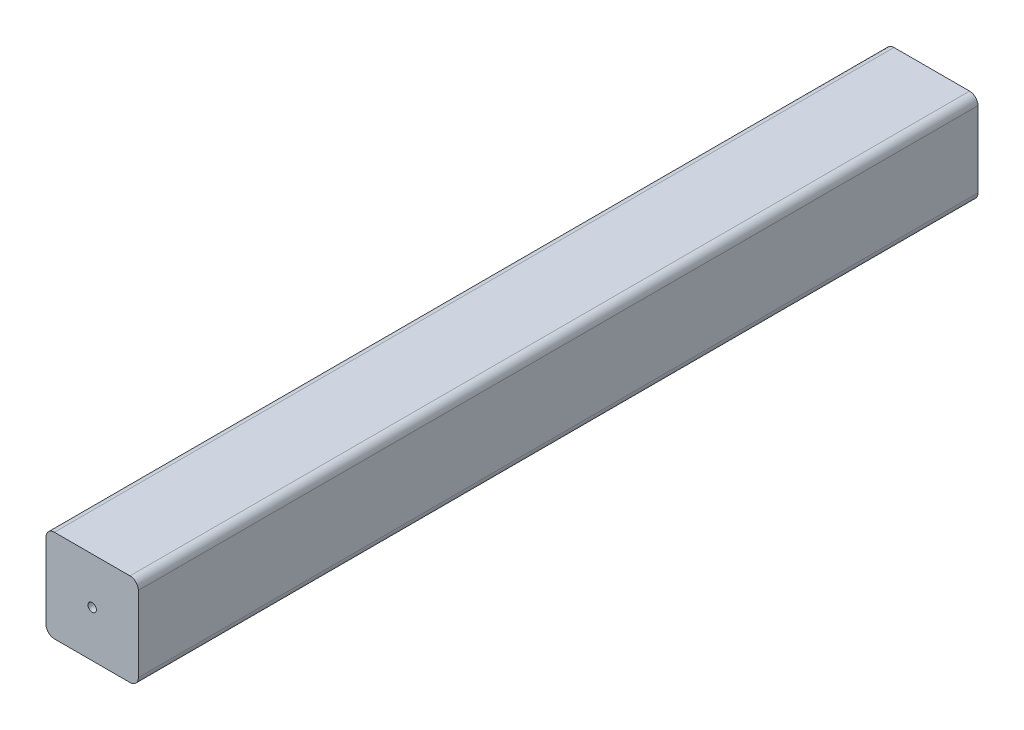
ISO-10303-21;
HEADER;
FILE_DESCRIPTION(('STEP AP214'),'2;1');
FILE_NAME('part.step','',(''),(''),'','','');
FILE_SCHEMA(('AUTOMOTIVE_DESIGN { 1 0 10303 214 1 1 1 1 }'));
ENDSEC;
DATA;
#1=APPLICATION_CONTEXT('core data for automotive mechanical design processes');
#2=APPLICATION_PROTOCOL_DEFINITION('international standard','automotive_design',2000,#1);
#3=PRODUCT_CONTEXT('',#1,'mechanical');
#4=PRODUCT('Part','Part','',(#3));
#5=PRODUCT_RELATED_PRODUCT_CATEGORY('part','',(#4));
#6=PRODUCT_DEFINITION_FORMATION('','',#4);
#7=PRODUCT_DEFINITION_CONTEXT('part definition',#1,'design');
#8=PRODUCT_DEFINITION('design','',#6,#7);
#9=PRODUCT_DEFINITION_SHAPE('','',#8);
#10=(LENGTH_UNIT() NAMED_UNIT(*) SI_UNIT(.MILLI.,.METRE.));
#11=(NAMED_UNIT(*) PLANE_ANGLE_UNIT() SI_UNIT($,.RADIAN.));
#12=(NAMED_UNIT(*) SI_UNIT($,.STERADIAN.) SOLID_ANGLE_UNIT());
#13=UNCERTAINTY_MEASURE_WITH_UNIT(LENGTH_MEASURE(1.E-05),#10,'distance_accuracy_value','');
#14=(GEOMETRIC_REPRESENTATION_CONTEXT(3) GLOBAL_UNCERTAINTY_ASSIGNED_CONTEXT((#13)) GLOBAL_UNIT_ASSIGNED_CONTEXT((#10,
#11,#12)) REPRESENTATION_CONTEXT('',''));
#15=CARTESIAN_POINT('',(0.,0.,0.));
#16=DIRECTION('',(0.,0.,1.));
#17=DIRECTION('',(1.,0.,0.));
#18=AXIS2_PLACEMENT_3D('',#15,#16,#17);
#19=CARTESIAN_POINT('',(-9.,9.,200.));
#20=DIRECTION('',(0.,0.,-1.));
#21=DIRECTION('',(-1.,0.,0.));
#22=AXIS2_PLACEMENT_3D('',#19,#20,#21);
#23=PLANE('',#22);
#24=CARTESIAN_POINT('',(-9.,9.,200.));
#25=DIRECTION('',(0.,0.,1.));
#26=DIRECTION('',(-1.,0.,0.));
#27=AXIS2_PLACEMENT_3D('',#24,#25,#26);
#28=CIRCLE('',#27,2.);
#29=CARTESIAN_POINT('',(-8.99999999999998,11.,200.));
#30=VERTEX_POINT('',#29);
#31=CARTESIAN_POINT('',(-11.,8.99999999999999,200.));
#32=VERTEX_POINT('',#31);
#33=EDGE_CURVE('E143',#30,#32,#28,.T.);
#34=ORIENTED_EDGE('',*,*,#33,.T.);
#35=DIRECTION('',(0.,-1.,0.));
#36=VECTOR('',#35,1.);
#37=CARTESIAN_POINT('',(-11.,-8.99999999999999,200.));
#38=LINE('',#37,#36);
#39=CARTESIAN_POINT('',(-11.,-8.99999999999999,200.));
#40=VERTEX_POINT('',#39);
#41=EDGE_CURVE('E91',#32,#40,#38,.T.);
#42=ORIENTED_EDGE('',*,*,#41,.T.);
#43=CARTESIAN_POINT('',(-9.,-9.,200.));
#44=DIRECTION('',(0.,0.,1.));
#45=DIRECTION('',(-1.,0.,0.));
#46=AXIS2_PLACEMENT_3D('',#43,#44,#45);
#47=CIRCLE('',#46,2.);
#48=CARTESIAN_POINT('',(-8.99999999999998,-11.,200.));
#49=VERTEX_POINT('',#48);
#50=EDGE_CURVE('E158',#40,#49,#47,.T.);
#51=ORIENTED_EDGE('',*,*,#50,.T.);
#52=DIRECTION('',(1.,0.,0.));
#53=VECTOR('',#52,1.);
#54=CARTESIAN_POINT('',(8.99999999999999,-11.,200.));
#55=LINE('',#54,#53);
#56=CARTESIAN_POINT('',(8.99999999999999,-11.,200.));
#57=VERTEX_POINT('',#56);
#58=EDGE_CURVE('E171',#49,#57,#55,.T.);
#59=ORIENTED_EDGE('',*,*,#58,.T.);
#60=CARTESIAN_POINT('',(9.,-9.,200.));
#61=DIRECTION('',(0.,0.,1.));
#62=DIRECTION('',(-1.,0.,0.));
#63=AXIS2_PLACEMENT_3D('',#60,#61,#62);
#64=CIRCLE('',#63,2.);
#65=CARTESIAN_POINT('',(11.,-8.99999999999999,200.));
#66=VERTEX_POINT('',#65);
#67=EDGE_CURVE('E110',#57,#66,#64,.T.);
#68=ORIENTED_EDGE('',*,*,#67,.T.);
#69=DIRECTION('',(0.,1.,0.));
#70=VECTOR('',#69,1.);
#71=CARTESIAN_POINT('',(11.,8.99999999999999,200.));
#72=LINE('',#71,#70);
#73=CARTESIAN_POINT('',(11.,8.99999999999999,200.));
#74=VERTEX_POINT('',#73);
#75=EDGE_CURVE('E104',#66,#74,#72,.T.);
#76=ORIENTED_EDGE('',*,*,#75,.T.);
#77=CARTESIAN_POINT('',(9.,9.,200.));
#78=DIRECTION('',(0.,0.,1.));
#79=DIRECTION('',(-1.,0.,0.));
#80=AXIS2_PLACEMENT_3D('',#77,#78,#79);
#81=CIRCLE('',#80,2.);
#82=CARTESIAN_POINT('',(8.99999999999999,11.,200.));
#83=VERTEX_POINT('',#82);
#84=EDGE_CURVE('E108',#74,#83,#81,.T.);
#85=ORIENTED_EDGE('',*,*,#84,.T.);
#86=DIRECTION('',(-1.,0.,0.));
#87=VECTOR('',#86,1.);
#88=CARTESIAN_POINT('',(-8.99999999999998,11.,200.));
#89=LINE('',#88,#87);
#90=EDGE_CURVE('E48',#83,#30,#89,.T.);
#91=ORIENTED_EDGE('',*,*,#90,.T.);
#92=EDGE_LOOP('',(#34,#42,#51,#59,#68,#76,#85,#91));
#93=FACE_BOUND('',#92,.T.);
#94=CARTESIAN_POINT('',(0.,0.,200.));
#95=DIRECTION('',(0.,0.,1.));
#96=DIRECTION('',(1.,0.,0.));
#97=AXIS2_PLACEMENT_3D('',#94,#95,#96);
#98=CIRCLE('',#97,1.);
#99=CARTESIAN_POINT('',(1.,0.,200.));
#100=VERTEX_POINT('',#99);
#101=EDGE_CURVE('E132',#100,#100,#98,.T.);
#102=ORIENTED_EDGE('',*,*,#101,.F.);
#103=EDGE_LOOP('',(#102));
#104=FACE_BOUND('',#103,.T.);
#105=ADVANCED_FACE('F31',(#93,#104),#23,.F.);
#106=CARTESIAN_POINT('',(-9.,9.,0.));
#107=DIRECTION('',(0.,0.,-1.));
#108=DIRECTION('',(-1.,0.,0.));
#109=AXIS2_PLACEMENT_3D('',#106,#107,#108);
#110=PLANE('',#109);
#111=CARTESIAN_POINT('',(-9.,9.,0.));
#112=DIRECTION('',(0.,0.,1.));
#113=DIRECTION('',(-1.,0.,0.));
#114=AXIS2_PLACEMENT_3D('',#111,#112,#113);
#115=CIRCLE('',#114,2.);
#116=CARTESIAN_POINT('',(-8.99999999999998,11.,0.));
#117=VERTEX_POINT('',#116);
#118=CARTESIAN_POINT('',(-11.,8.99999999999999,0.));
#119=VERTEX_POINT('',#118);
#120=EDGE_CURVE('E128',#117,#119,#115,.T.);
#121=ORIENTED_EDGE('',*,*,#120,.F.);
#122=DIRECTION('',(-1.,0.,0.));
#123=VECTOR('',#122,1.);
#124=CARTESIAN_POINT('',(-8.99999999999998,11.,0.));
#125=LINE('',#124,#123);
#126=CARTESIAN_POINT('',(8.99999999999999,11.,0.));
#127=VERTEX_POINT('',#126);
#128=EDGE_CURVE('E83',#127,#117,#125,.T.);
#129=ORIENTED_EDGE('',*,*,#128,.F.);
#130=CARTESIAN_POINT('',(9.,9.,0.));
#131=DIRECTION('',(0.,0.,1.));
#132=DIRECTION('',(-1.,0.,0.));
#133=AXIS2_PLACEMENT_3D('',#130,#131,#132);
#134=CIRCLE('',#133,2.);
#135=CARTESIAN_POINT('',(11.,8.99999999999999,0.));
#136=VERTEX_POINT('',#135);
#137=EDGE_CURVE('E77',#136,#127,#134,.T.);
#138=ORIENTED_EDGE('',*,*,#137,.F.);
#139=DIRECTION('',(0.,1.,0.));
#140=VECTOR('',#139,1.);
#141=CARTESIAN_POINT('',(11.,8.99999999999999,0.));
#142=LINE('',#141,#140);
#143=CARTESIAN_POINT('',(11.,-8.99999999999999,0.));
#144=VERTEX_POINT('',#143);
#145=EDGE_CURVE('E118',#144,#136,#142,.T.);
#146=ORIENTED_EDGE('',*,*,#145,.F.);
#147=CARTESIAN_POINT('',(9.,-9.,0.));
#148=DIRECTION('',(0.,0.,1.));
#149=DIRECTION('',(-1.,0.,0.));
#150=AXIS2_PLACEMENT_3D('',#147,#148,#149);
#151=CIRCLE('',#150,2.);
#152=CARTESIAN_POINT('',(8.99999999999999,-11.,0.));
#153=VERTEX_POINT('',#152);
#154=EDGE_CURVE('E138',#153,#144,#151,.T.);
#155=ORIENTED_EDGE('',*,*,#154,.F.);
#156=DIRECTION('',(1.,0.,0.));
#157=VECTOR('',#156,1.);
#158=CARTESIAN_POINT('',(8.99999999999999,-11.,0.));
#159=LINE('',#158,#157);
#160=CARTESIAN_POINT('',(-8.99999999999998,-11.,0.));
#161=VERTEX_POINT('',#160);
#162=EDGE_CURVE('E136',#161,#153,#159,.T.);
#163=ORIENTED_EDGE('',*,*,#162,.F.);
#164=CARTESIAN_POINT('',(-9.,-9.,0.));
#165=DIRECTION('',(0.,0.,1.));
#166=DIRECTION('',(-1.,0.,0.));
#167=AXIS2_PLACEMENT_3D('',#164,#165,#166);
#168=CIRCLE('',#167,2.);
#169=CARTESIAN_POINT('',(-11.,-8.99999999999999,0.));
#170=VERTEX_POINT('',#169);
#171=EDGE_CURVE('E134',#170,#161,#168,.T.);
#172=ORIENTED_EDGE('',*,*,#171,.F.);
#173=DIRECTION('',(0.,-1.,0.));
#174=VECTOR('',#173,1.);
#175=CARTESIAN_POINT('',(-11.,-8.99999999999999,0.));
#176=LINE('',#175,#174);
#177=EDGE_CURVE('E131',#119,#170,#176,.T.);
#178=ORIENTED_EDGE('',*,*,#177,.F.);
#179=EDGE_LOOP('',(#121,#129,#138,#146,#155,#163,#172,#178));
#180=FACE_BOUND('',#179,.T.);
#181=CARTESIAN_POINT('',(0.,0.,0.));
#182=DIRECTION('',(0.,0.,1.));
#183=DIRECTION('',(1.,0.,0.));
#184=AXIS2_PLACEMENT_3D('',#181,#182,#183);
#185=CIRCLE('',#184,1.);
#186=CARTESIAN_POINT('',(1.,0.,0.));
#187=VERTEX_POINT('',#186);
#188=EDGE_CURVE('E177',#187,#187,#185,.T.);
#189=ORIENTED_EDGE('',*,*,#188,.T.);
#190=EDGE_LOOP('',(#189));
#191=FACE_BOUND('',#190,.T.);
#192=ADVANCED_FACE('F162',(#180,#191),#110,.T.);
#193=CARTESIAN_POINT('',(-9.,9.,200.));
#194=DIRECTION('',(0.,0.,-1.));
#195=DIRECTION('',(-1.,0.,0.));
#196=AXIS2_PLACEMENT_3D('',#193,#194,#195);
#197=CYLINDRICAL_SURFACE('',#196,2.);
#198=ORIENTED_EDGE('',*,*,#120,.T.);
#199=DIRECTION('',(0.,0.,-1.));
#200=VECTOR('',#199,1.);
#201=CARTESIAN_POINT('',(-11.,8.99999999999999,200.));
#202=LINE('',#201,#200);
#203=EDGE_CURVE('E11',#32,#119,#202,.T.);
#204=ORIENTED_EDGE('',*,*,#203,.F.);
#205=ORIENTED_EDGE('',*,*,#33,.F.);
#206=DIRECTION('',(0.,0.,-1.));
#207=VECTOR('',#206,1.);
#208=CARTESIAN_POINT('',(-8.99999999999998,11.,200.));
#209=LINE('',#208,#207);
#210=EDGE_CURVE('E124',#30,#117,#209,.T.);
#211=ORIENTED_EDGE('',*,*,#210,.T.);
#212=EDGE_LOOP('',(#198,#204,#205,#211));
#213=FACE_BOUND('',#212,.T.);
#214=ADVANCED_FACE('F33',(#213),#197,.T.);
#215=CARTESIAN_POINT('',(-11.,-8.99999999999999,200.));
#216=DIRECTION('',(1.,0.,0.));
#217=DIRECTION('',(0.,0.,-1.));
#218=AXIS2_PLACEMENT_3D('',#215,#216,#217);
#219=PLANE('',#218);
#220=ORIENTED_EDGE('',*,*,#177,.T.);
#221=DIRECTION('',(0.,0.,-1.));
#222=VECTOR('',#221,1.);
#223=CARTESIAN_POINT('',(-11.,-8.99999999999999,200.));
#224=LINE('',#223,#222);
#225=EDGE_CURVE('E40',#40,#170,#224,.T.);
#226=ORIENTED_EDGE('',*,*,#225,.F.);
#227=ORIENTED_EDGE('',*,*,#41,.F.);
#228=ORIENTED_EDGE('',*,*,#203,.T.);
#229=EDGE_LOOP('',(#220,#226,#227,#228));
#230=FACE_BOUND('',#229,.T.);
#231=ADVANCED_FACE('F205',(#230),#219,.F.);
#232=CARTESIAN_POINT('',(-9.,-9.,200.));
#233=DIRECTION('',(0.,0.,-1.));
#234=DIRECTION('',(-1.,0.,0.));
#235=AXIS2_PLACEMENT_3D('',#232,#233,#234);
#236=CYLINDRICAL_SURFACE('',#235,2.);
#237=ORIENTED_EDGE('',*,*,#171,.T.);
#238=DIRECTION('',(0.,0.,-1.));
#239=VECTOR('',#238,1.);
#240=CARTESIAN_POINT('',(-8.99999999999998,-11.,200.));
#241=LINE('',#240,#239);
#242=EDGE_CURVE('E150',#49,#161,#241,.T.);
#243=ORIENTED_EDGE('',*,*,#242,.F.);
#244=ORIENTED_EDGE('',*,*,#50,.F.);
#245=ORIENTED_EDGE('',*,*,#225,.T.);
#246=EDGE_LOOP('',(#237,#243,#244,#245));
#247=FACE_BOUND('',#246,.T.);
#248=ADVANCED_FACE('F156',(#247),#236,.T.);
#249=CARTESIAN_POINT('',(8.99999999999999,-11.,200.));
#250=DIRECTION('',(0.,1.,0.));
#251=DIRECTION('',(-1.,0.,0.));
#252=AXIS2_PLACEMENT_3D('',#249,#250,#251);
#253=PLANE('',#252);
#254=ORIENTED_EDGE('',*,*,#162,.T.);
#255=DIRECTION('',(0.,0.,-1.));
#256=VECTOR('',#255,1.);
#257=CARTESIAN_POINT('',(8.99999999999999,-11.,200.));
#258=LINE('',#257,#256);
#259=EDGE_CURVE('E147',#57,#153,#258,.T.);
#260=ORIENTED_EDGE('',*,*,#259,.F.);
#261=ORIENTED_EDGE('',*,*,#58,.F.);
#262=ORIENTED_EDGE('',*,*,#242,.T.);
#263=EDGE_LOOP('',(#254,#260,#261,#262));
#264=FACE_BOUND('',#263,.T.);
#265=ADVANCED_FACE('F167',(#264),#253,.F.);
#266=CARTESIAN_POINT('',(9.,-9.,200.));
#267=DIRECTION('',(0.,0.,-1.));
#268=DIRECTION('',(-1.,0.,0.));
#269=AXIS2_PLACEMENT_3D('',#266,#267,#268);
#270=CYLINDRICAL_SURFACE('',#269,2.);
#271=ORIENTED_EDGE('',*,*,#154,.T.);
#272=DIRECTION('',(0.,0.,-1.));
#273=VECTOR('',#272,1.);
#274=CARTESIAN_POINT('',(11.,-8.99999999999999,200.));
#275=LINE('',#274,#273);
#276=EDGE_CURVE('E119',#66,#144,#275,.T.);
#277=ORIENTED_EDGE('',*,*,#276,.F.);
#278=ORIENTED_EDGE('',*,*,#67,.F.);
#279=ORIENTED_EDGE('',*,*,#259,.T.);
#280=EDGE_LOOP('',(#271,#277,#278,#279));
#281=FACE_BOUND('',#280,.T.);
#282=ADVANCED_FACE('F170',(#281),#270,.T.);
#283=CARTESIAN_POINT('',(11.,8.99999999999999,200.));
#284=DIRECTION('',(-1.,0.,0.));
#285=DIRECTION('',(0.,-1.,0.));
#286=AXIS2_PLACEMENT_3D('',#283,#284,#285);
#287=PLANE('',#286);
#288=ORIENTED_EDGE('',*,*,#145,.T.);
#289=DIRECTION('',(0.,0.,-1.));
#290=VECTOR('',#289,1.);
#291=CARTESIAN_POINT('',(11.,8.99999999999999,200.));
#292=LINE('',#291,#290);
#293=EDGE_CURVE('E115',#74,#136,#292,.T.);
#294=ORIENTED_EDGE('',*,*,#293,.F.);
#295=ORIENTED_EDGE('',*,*,#75,.F.);
#296=ORIENTED_EDGE('',*,*,#276,.T.);
#297=EDGE_LOOP('',(#288,#294,#295,#296));
#298=FACE_BOUND('',#297,.T.);
#299=ADVANCED_FACE('F116',(#298),#287,.F.);
#300=CARTESIAN_POINT('',(9.,9.,200.));
#301=DIRECTION('',(0.,0.,-1.));
#302=DIRECTION('',(-1.,0.,0.));
#303=AXIS2_PLACEMENT_3D('',#300,#301,#302);
#304=CYLINDRICAL_SURFACE('',#303,2.);
#305=ORIENTED_EDGE('',*,*,#137,.T.);
#306=DIRECTION('',(0.,0.,-1.));
#307=VECTOR('',#306,1.);
#308=CARTESIAN_POINT('',(8.99999999999999,11.,200.));
#309=LINE('',#308,#307);
#310=EDGE_CURVE('E120',#83,#127,#309,.T.);
#311=ORIENTED_EDGE('',*,*,#310,.F.);
#312=ORIENTED_EDGE('',*,*,#84,.F.);
#313=ORIENTED_EDGE('',*,*,#293,.T.);
#314=EDGE_LOOP('',(#305,#311,#312,#313));
#315=FACE_BOUND('',#314,.T.);
#316=ADVANCED_FACE('F122',(#315),#304,.T.);
#317=CARTESIAN_POINT('',(-8.99999999999998,11.,200.));
#318=DIRECTION('',(0.,-1.,0.));
#319=DIRECTION('',(0.,0.,-1.));
#320=AXIS2_PLACEMENT_3D('',#317,#318,#319);
#321=PLANE('',#320);
#322=ORIENTED_EDGE('',*,*,#128,.T.);
#323=ORIENTED_EDGE('',*,*,#210,.F.);
#324=ORIENTED_EDGE('',*,*,#90,.F.);
#325=ORIENTED_EDGE('',*,*,#310,.T.);
#326=EDGE_LOOP('',(#322,#323,#324,#325));
#327=FACE_BOUND('',#326,.T.);
#328=ADVANCED_FACE('F193',(#327),#321,.F.);
#329=CARTESIAN_POINT('',(0.,0.,200.));
#330=DIRECTION('',(0.,0.,-1.));
#331=DIRECTION('',(-1.,0.,0.));
#332=AXIS2_PLACEMENT_3D('',#329,#330,#331);
#333=CYLINDRICAL_SURFACE('',#332,1.);
#334=ORIENTED_EDGE('',*,*,#101,.T.);
#335=EDGE_LOOP('',(#334));
#336=FACE_BOUND('',#335,.T.);
#337=ORIENTED_EDGE('',*,*,#188,.F.);
#338=EDGE_LOOP('',(#337));
#339=FACE_BOUND('',#338,.T.);
#340=ADVANCED_FACE('F183',(#336,#339),#333,.F.);
#341=CLOSED_SHELL('',(#105,#192,#214,#231,#248,#265,#282,#299,#316,#328,#340));
#342=MANIFOLD_SOLID_BREP('B2',#341);
#343=ADVANCED_BREP_SHAPE_REPRESENTATION('',(#18,#342),#14);
#344=SHAPE_DEFINITION_REPRESENTATION(#9,#343);
ENDSEC;
END-ISO-10303-21;
